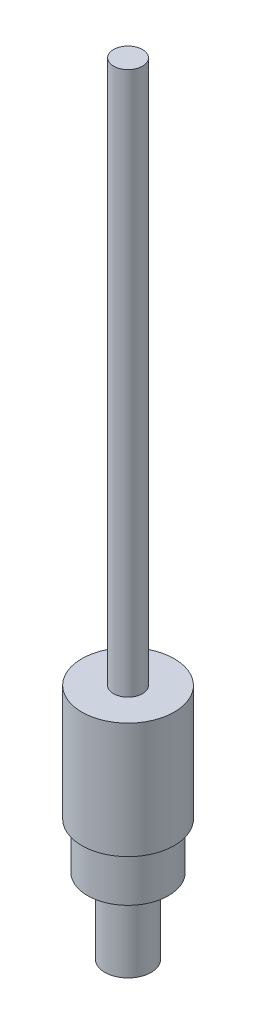
ISO-10303-21;
HEADER;
FILE_DESCRIPTION(('STEP AP214'),'2;1');
FILE_NAME('part.step','',(''),(''),'','','');
FILE_SCHEMA(('AUTOMOTIVE_DESIGN { 1 0 10303 214 1 1 1 1 }'));
ENDSEC;
DATA;
#1=APPLICATION_CONTEXT('core data for automotive mechanical design processes');
#2=APPLICATION_PROTOCOL_DEFINITION('international standard','automotive_design',2000,#1);
#3=PRODUCT_CONTEXT('',#1,'mechanical');
#4=PRODUCT('Part','Part','',(#3));
#5=PRODUCT_RELATED_PRODUCT_CATEGORY('part','',(#4));
#6=PRODUCT_DEFINITION_FORMATION('','',#4);
#7=PRODUCT_DEFINITION_CONTEXT('part definition',#1,'design');
#8=PRODUCT_DEFINITION('design','',#6,#7);
#9=PRODUCT_DEFINITION_SHAPE('','',#8);
#10=(LENGTH_UNIT() NAMED_UNIT(*) SI_UNIT(.MILLI.,.METRE.));
#11=(NAMED_UNIT(*) PLANE_ANGLE_UNIT() SI_UNIT($,.RADIAN.));
#12=(NAMED_UNIT(*) SI_UNIT($,.STERADIAN.) SOLID_ANGLE_UNIT());
#13=UNCERTAINTY_MEASURE_WITH_UNIT(LENGTH_MEASURE(1.E-05),#10,'distance_accuracy_value','');
#14=(GEOMETRIC_REPRESENTATION_CONTEXT(3) GLOBAL_UNCERTAINTY_ASSIGNED_CONTEXT((#13)) GLOBAL_UNIT_ASSIGNED_CONTEXT((#10,
#11,#12)) REPRESENTATION_CONTEXT('',''));
#15=CARTESIAN_POINT('',(0.,0.,0.));
#16=DIRECTION('',(0.,0.,1.));
#17=DIRECTION('',(1.,0.,0.));
#18=AXIS2_PLACEMENT_3D('',#15,#16,#17);
#19=CARTESIAN_POINT('',(0.,0.,0.));
#20=DIRECTION('',(0.,1.,0.));
#21=DIRECTION('',(0.,0.,1.));
#22=AXIS2_PLACEMENT_3D('',#19,#20,#21);
#23=PLANE('',#22);
#24=CARTESIAN_POINT('',(0.,0.,0.));
#25=DIRECTION('',(0.,-1.,0.));
#26=DIRECTION('',(0.,0.,-1.));
#27=AXIS2_PLACEMENT_3D('',#24,#25,#26);
#28=CIRCLE('',#27,4.);
#29=CARTESIAN_POINT('',(0.,0.,-4.));
#30=VERTEX_POINT('',#29);
#31=EDGE_CURVE('E10',#30,#30,#28,.T.);
#32=ORIENTED_EDGE('',*,*,#31,.T.);
#33=EDGE_LOOP('',(#32));
#34=FACE_BOUND('',#33,.T.);
#35=ADVANCED_FACE('F30',(#34),#23,.F.);
#36=CARTESIAN_POINT('',(0.,0.,0.));
#37=DIRECTION('',(0.,-1.,0.));
#38=DIRECTION('',(0.,0.,-1.));
#39=AXIS2_PLACEMENT_3D('',#36,#37,#38);
#40=CYLINDRICAL_SURFACE('',#39,4.);
#41=ORIENTED_EDGE('',*,*,#31,.F.);
#42=EDGE_LOOP('',(#41));
#43=FACE_BOUND('',#42,.T.);
#44=CARTESIAN_POINT('',(0.,13.,0.));
#45=DIRECTION('',(0.,-1.,0.));
#46=DIRECTION('',(0.,0.,-1.));
#47=AXIS2_PLACEMENT_3D('',#44,#45,#46);
#48=CIRCLE('',#47,4.);
#49=CARTESIAN_POINT('',(0.,13.,-4.));
#50=VERTEX_POINT('',#49);
#51=EDGE_CURVE('E36',#50,#50,#48,.T.);
#52=ORIENTED_EDGE('',*,*,#51,.T.);
#53=EDGE_LOOP('',(#52));
#54=FACE_BOUND('',#53,.T.);
#55=ADVANCED_FACE('F74',(#43,#54),#40,.T.);
#56=CARTESIAN_POINT('',(-4.,13.,0.));
#57=DIRECTION('',(0.,1.,0.));
#58=DIRECTION('',(0.,0.,1.));
#59=AXIS2_PLACEMENT_3D('',#56,#57,#58);
#60=PLANE('',#59);
#61=ORIENTED_EDGE('',*,*,#51,.F.);
#62=EDGE_LOOP('',(#61));
#63=FACE_BOUND('',#62,.T.);
#64=CARTESIAN_POINT('',(0.,13.,0.));
#65=DIRECTION('',(0.,-1.,0.));
#66=DIRECTION('',(0.,0.,-1.));
#67=AXIS2_PLACEMENT_3D('',#64,#65,#66);
#68=CIRCLE('',#67,7.);
#69=CARTESIAN_POINT('',(0.,13.,-7.));
#70=VERTEX_POINT('',#69);
#71=EDGE_CURVE('E40',#70,#70,#68,.T.);
#72=ORIENTED_EDGE('',*,*,#71,.T.);
#73=EDGE_LOOP('',(#72));
#74=FACE_BOUND('',#73,.T.);
#75=ADVANCED_FACE('F78',(#63,#74),#60,.F.);
#76=CARTESIAN_POINT('',(0.,0.,0.));
#77=DIRECTION('',(0.,-1.,0.));
#78=DIRECTION('',(0.,0.,-1.));
#79=AXIS2_PLACEMENT_3D('',#76,#77,#78);
#80=CYLINDRICAL_SURFACE('',#79,7.);
#81=ORIENTED_EDGE('',*,*,#71,.F.);
#82=EDGE_LOOP('',(#81));
#83=FACE_BOUND('',#82,.T.);
#84=CARTESIAN_POINT('',(0.,21.,0.));
#85=DIRECTION('',(0.,-1.,0.));
#86=DIRECTION('',(0.,0.,-1.));
#87=AXIS2_PLACEMENT_3D('',#84,#85,#86);
#88=CIRCLE('',#87,7.);
#89=CARTESIAN_POINT('',(0.,21.,-7.));
#90=VERTEX_POINT('',#89);
#91=EDGE_CURVE('E44',#90,#90,#88,.T.);
#92=ORIENTED_EDGE('',*,*,#91,.T.);
#93=EDGE_LOOP('',(#92));
#94=FACE_BOUND('',#93,.T.);
#95=ADVANCED_FACE('F83',(#83,#94),#80,.T.);
#96=CARTESIAN_POINT('',(-7.,21.,0.));
#97=DIRECTION('',(0.,1.,0.));
#98=DIRECTION('',(0.,0.,1.));
#99=AXIS2_PLACEMENT_3D('',#96,#97,#98);
#100=PLANE('',#99);
#101=ORIENTED_EDGE('',*,*,#91,.F.);
#102=EDGE_LOOP('',(#101));
#103=FACE_BOUND('',#102,.T.);
#104=CARTESIAN_POINT('',(0.,21.,0.));
#105=DIRECTION('',(0.,-1.,0.));
#106=DIRECTION('',(0.,0.,-1.));
#107=AXIS2_PLACEMENT_3D('',#104,#105,#106);
#108=CIRCLE('',#107,8.);
#109=CARTESIAN_POINT('',(0.,21.,-8.));
#110=VERTEX_POINT('',#109);
#111=EDGE_CURVE('E49',#110,#110,#108,.T.);
#112=ORIENTED_EDGE('',*,*,#111,.T.);
#113=EDGE_LOOP('',(#112));
#114=FACE_BOUND('',#113,.T.);
#115=ADVANCED_FACE('F89',(#103,#114),#100,.F.);
#116=CARTESIAN_POINT('',(0.,0.,0.));
#117=DIRECTION('',(0.,-1.,0.));
#118=DIRECTION('',(0.,0.,-1.));
#119=AXIS2_PLACEMENT_3D('',#116,#117,#118);
#120=CYLINDRICAL_SURFACE('',#119,8.00000000000001);
#121=ORIENTED_EDGE('',*,*,#111,.F.);
#122=EDGE_LOOP('',(#121));
#123=FACE_BOUND('',#122,.T.);
#124=CARTESIAN_POINT('',(0.,41.,0.));
#125=DIRECTION('',(0.,-1.,0.));
#126=DIRECTION('',(0.,0.,-1.));
#127=AXIS2_PLACEMENT_3D('',#124,#125,#126);
#128=CIRCLE('',#127,8.00000000000001);
#129=CARTESIAN_POINT('',(0.,41.,-8.00000000000001));
#130=VERTEX_POINT('',#129);
#131=EDGE_CURVE('E52',#130,#130,#128,.T.);
#132=ORIENTED_EDGE('',*,*,#131,.T.);
#133=EDGE_LOOP('',(#132));
#134=FACE_BOUND('',#133,.T.);
#135=ADVANCED_FACE('F93',(#123,#134),#120,.T.);
#136=CARTESIAN_POINT('',(-8.00000000000001,41.,0.));
#137=DIRECTION('',(0.,-1.,0.));
#138=DIRECTION('',(0.,0.,-1.));
#139=AXIS2_PLACEMENT_3D('',#136,#137,#138);
#140=PLANE('',#139);
#141=ORIENTED_EDGE('',*,*,#131,.F.);
#142=EDGE_LOOP('',(#141));
#143=FACE_BOUND('',#142,.T.);
#144=CARTESIAN_POINT('',(0.,41.,0.));
#145=DIRECTION('',(0.,-1.,0.));
#146=DIRECTION('',(0.,0.,-1.));
#147=AXIS2_PLACEMENT_3D('',#144,#145,#146);
#148=CIRCLE('',#147,2.50000000000001);
#149=CARTESIAN_POINT('',(0.,41.,-2.50000000000001));
#150=VERTEX_POINT('',#149);
#151=EDGE_CURVE('E55',#150,#150,#148,.T.);
#152=ORIENTED_EDGE('',*,*,#151,.T.);
#153=EDGE_LOOP('',(#152));
#154=FACE_BOUND('',#153,.T.);
#155=ADVANCED_FACE('F70',(#143,#154),#140,.F.);
#156=CARTESIAN_POINT('',(0.,0.,0.));
#157=DIRECTION('',(0.,-1.,0.));
#158=DIRECTION('',(0.,0.,-1.));
#159=AXIS2_PLACEMENT_3D('',#156,#157,#158);
#160=CYLINDRICAL_SURFACE('',#159,2.50000000000002);
#161=ORIENTED_EDGE('',*,*,#151,.F.);
#162=EDGE_LOOP('',(#161));
#163=FACE_BOUND('',#162,.T.);
#164=CARTESIAN_POINT('',(0.,135.,0.));
#165=DIRECTION('',(0.,-1.,0.));
#166=DIRECTION('',(0.,0.,-1.));
#167=AXIS2_PLACEMENT_3D('',#164,#165,#166);
#168=CIRCLE('',#167,2.50000000000003);
#169=CARTESIAN_POINT('',(0.,135.,-2.50000000000003));
#170=VERTEX_POINT('',#169);
#171=EDGE_CURVE('E58',#170,#170,#168,.T.);
#172=ORIENTED_EDGE('',*,*,#171,.T.);
#173=EDGE_LOOP('',(#172));
#174=FACE_BOUND('',#173,.T.);
#175=ADVANCED_FACE('F62',(#163,#174),#160,.T.);
#176=CARTESIAN_POINT('',(-2.50000000000003,135.,0.));
#177=DIRECTION('',(0.,-1.,0.));
#178=DIRECTION('',(0.,0.,-1.));
#179=AXIS2_PLACEMENT_3D('',#176,#177,#178);
#180=PLANE('',#179);
#181=ORIENTED_EDGE('',*,*,#171,.F.);
#182=EDGE_LOOP('',(#181));
#183=FACE_BOUND('',#182,.T.);
#184=ADVANCED_FACE('F64',(#183),#180,.F.);
#185=CLOSED_SHELL('',(#35,#55,#75,#95,#115,#135,#155,#175,#184));
#186=MANIFOLD_SOLID_BREP('B2',#185);
#187=ADVANCED_BREP_SHAPE_REPRESENTATION('',(#18,#186),#14);
#188=SHAPE_DEFINITION_REPRESENTATION(#9,#187);
ENDSEC;
END-ISO-10303-21;
